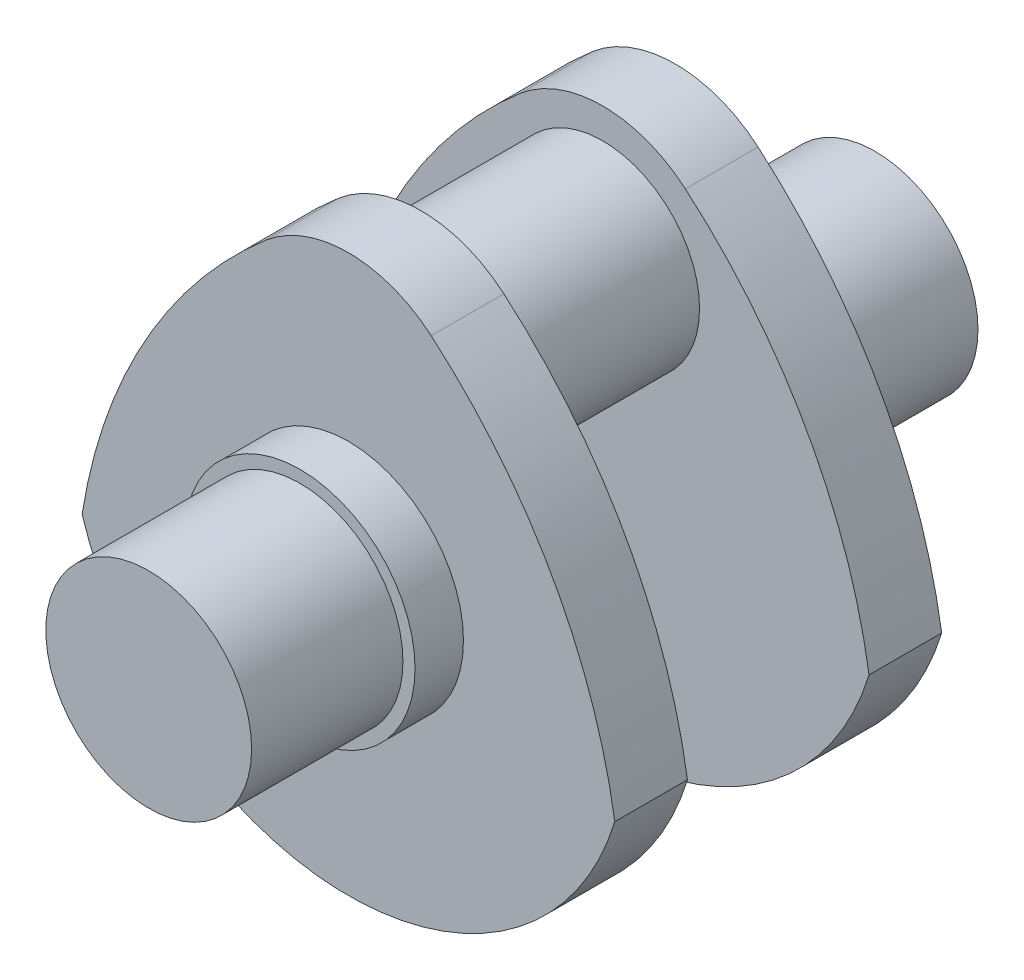
ISO-10303-21;
HEADER;
FILE_DESCRIPTION(('STEP AP214'),'2;1');
FILE_NAME('part.step','',(''),(''),'','','');
FILE_SCHEMA(('AUTOMOTIVE_DESIGN { 1 0 10303 214 1 1 1 1 }'));
ENDSEC;
DATA;
#1=APPLICATION_CONTEXT('core data for automotive mechanical design processes');
#2=APPLICATION_PROTOCOL_DEFINITION('international standard','automotive_design',2000,#1);
#3=PRODUCT_CONTEXT('',#1,'mechanical');
#4=PRODUCT('Part','Part','',(#3));
#5=PRODUCT_RELATED_PRODUCT_CATEGORY('part','',(#4));
#6=PRODUCT_DEFINITION_FORMATION('','',#4);
#7=PRODUCT_DEFINITION_CONTEXT('part definition',#1,'design');
#8=PRODUCT_DEFINITION('design','',#6,#7);
#9=PRODUCT_DEFINITION_SHAPE('','',#8);
#10=(LENGTH_UNIT() NAMED_UNIT(*) SI_UNIT(.MILLI.,.METRE.));
#11=(NAMED_UNIT(*) PLANE_ANGLE_UNIT() SI_UNIT($,.RADIAN.));
#12=(NAMED_UNIT(*) SI_UNIT($,.STERADIAN.) SOLID_ANGLE_UNIT());
#13=UNCERTAINTY_MEASURE_WITH_UNIT(LENGTH_MEASURE(1.E-05),#10,'distance_accuracy_value','');
#14=(GEOMETRIC_REPRESENTATION_CONTEXT(3) GLOBAL_UNCERTAINTY_ASSIGNED_CONTEXT((#13)) GLOBAL_UNIT_ASSIGNED_CONTEXT((#10,
#11,#12)) REPRESENTATION_CONTEXT('',''));
#15=CARTESIAN_POINT('',(0.,0.,0.));
#16=DIRECTION('',(0.,0.,1.));
#17=DIRECTION('',(1.,0.,0.));
#18=AXIS2_PLACEMENT_3D('',#15,#16,#17);
#19=CARTESIAN_POINT('',(0.,0.,25.));
#20=DIRECTION('',(0.,0.,-1.));
#21=DIRECTION('',(-1.,0.,0.));
#22=AXIS2_PLACEMENT_3D('',#19,#20,#21);
#23=CYLINDRICAL_SURFACE('',#22,17.);
#24=CARTESIAN_POINT('',(0.,0.,25.));
#25=DIRECTION('',(0.,0.,1.));
#26=DIRECTION('',(1.,0.,0.));
#27=AXIS2_PLACEMENT_3D('',#24,#25,#26);
#28=CIRCLE('',#27,17.);
#29=CARTESIAN_POINT('',(17.,0.,25.));
#30=VERTEX_POINT('',#29);
#31=EDGE_CURVE('E48',#30,#30,#28,.T.);
#32=ORIENTED_EDGE('',*,*,#31,.F.);
#33=EDGE_LOOP('',(#32));
#34=FACE_BOUND('',#33,.T.);
#35=CARTESIAN_POINT('',(0.,0.,0.));
#36=DIRECTION('',(0.,0.,1.));
#37=DIRECTION('',(1.,0.,0.));
#38=AXIS2_PLACEMENT_3D('',#35,#36,#37);
#39=CIRCLE('',#38,17.);
#40=CARTESIAN_POINT('',(17.,0.,0.));
#41=VERTEX_POINT('',#40);
#42=EDGE_CURVE('E231',#41,#41,#39,.T.);
#43=ORIENTED_EDGE('',*,*,#42,.T.);
#44=EDGE_LOOP('',(#43));
#45=FACE_BOUND('',#44,.T.);
#46=ADVANCED_FACE('F39',(#34,#45),#23,.T.);
#47=CARTESIAN_POINT('',(0.,0.,25.));
#48=DIRECTION('',(0.,0.,1.));
#49=DIRECTION('',(1.,0.,0.));
#50=AXIS2_PLACEMENT_3D('',#47,#48,#49);
#51=PLANE('',#50);
#52=ORIENTED_EDGE('',*,*,#31,.T.);
#53=EDGE_LOOP('',(#52));
#54=FACE_BOUND('',#53,.T.);
#55=ADVANCED_FACE('F248',(#54),#51,.T.);
#56=CARTESIAN_POINT('',(0.,0.,-8.));
#57=DIRECTION('',(0.,0.,1.));
#58=DIRECTION('',(1.,0.,0.));
#59=AXIS2_PLACEMENT_3D('',#56,#57,#58);
#60=CYLINDRICAL_SURFACE('',#59,19.);
#61=CARTESIAN_POINT('',(0.,0.,-8.));
#62=DIRECTION('',(0.,0.,1.));
#63=DIRECTION('',(1.,0.,0.));
#64=AXIS2_PLACEMENT_3D('',#61,#62,#63);
#65=CIRCLE('',#64,19.);
#66=CARTESIAN_POINT('',(19.,0.,-8.));
#67=VERTEX_POINT('',#66);
#68=EDGE_CURVE('E223',#67,#67,#65,.T.);
#69=ORIENTED_EDGE('',*,*,#68,.T.);
#70=EDGE_LOOP('',(#69));
#71=FACE_BOUND('',#70,.T.);
#72=CARTESIAN_POINT('',(0.,0.,0.));
#73=DIRECTION('',(0.,0.,1.));
#74=DIRECTION('',(1.,0.,0.));
#75=AXIS2_PLACEMENT_3D('',#72,#73,#74);
#76=CIRCLE('',#75,19.);
#77=CARTESIAN_POINT('',(19.,0.,0.));
#78=VERTEX_POINT('',#77);
#79=EDGE_CURVE('E227',#78,#78,#76,.T.);
#80=ORIENTED_EDGE('',*,*,#79,.F.);
#81=EDGE_LOOP('',(#80));
#82=FACE_BOUND('',#81,.T.);
#83=ADVANCED_FACE('F243',(#71,#82),#60,.T.);
#84=CARTESIAN_POINT('',(0.,0.,0.));
#85=DIRECTION('',(0.,0.,1.));
#86=DIRECTION('',(1.,0.,0.));
#87=AXIS2_PLACEMENT_3D('',#84,#85,#86);
#88=PLANE('',#87);
#89=ORIENTED_EDGE('',*,*,#42,.F.);
#90=EDGE_LOOP('',(#89));
#91=FACE_BOUND('',#90,.T.);
#92=ORIENTED_EDGE('',*,*,#79,.T.);
#93=EDGE_LOOP('',(#92));
#94=FACE_BOUND('',#93,.T.);
#95=ADVANCED_FACE('F239',(#91,#94),#88,.T.);
#96=CARTESIAN_POINT('',(44.9094542035734,-27.3845485151599,-20.));
#97=DIRECTION('',(0.,0.,1.));
#98=DIRECTION('',(1.,0.,0.));
#99=AXIS2_PLACEMENT_3D('',#96,#97,#98);
#100=CYLINDRICAL_SURFACE('',#99,90.);
#101=CARTESIAN_POINT('',(44.9094542035734,-27.3845485151599,-8.));
#102=DIRECTION('',(0.,0.,-1.));
#103=DIRECTION('',(1.,0.,0.));
#104=AXIS2_PLACEMENT_3D('',#101,#102,#103);
#105=CIRCLE('',#104,90.);
#106=CARTESIAN_POINT('',(-44.,-13.4164078649987,-8.));
#107=VERTEX_POINT('',#106);
#108=CARTESIAN_POINT('',(-13.6680947576093,40.9431234611356,-8.));
#109=VERTEX_POINT('',#108);
#110=EDGE_CURVE('E190',#107,#109,#105,.T.);
#111=ORIENTED_EDGE('',*,*,#110,.T.);
#112=DIRECTION('',(0.,0.,1.));
#113=VECTOR('',#112,1.);
#114=CARTESIAN_POINT('',(-13.6680947576093,40.9431234611356,-20.));
#115=LINE('',#114,#113);
#116=CARTESIAN_POINT('',(-13.6680947576093,40.9431234611356,-20.));
#117=VERTEX_POINT('',#116);
#118=EDGE_CURVE('E220',#117,#109,#115,.T.);
#119=ORIENTED_EDGE('',*,*,#118,.F.);
#120=CARTESIAN_POINT('',(44.9094542035734,-27.3845485151599,-20.));
#121=DIRECTION('',(0.,0.,-1.));
#122=DIRECTION('',(1.,0.,0.));
#123=AXIS2_PLACEMENT_3D('',#120,#121,#122);
#124=CIRCLE('',#123,90.);
#125=CARTESIAN_POINT('',(-44.,-13.4164078649987,-20.));
#126=VERTEX_POINT('',#125);
#127=EDGE_CURVE('E191',#126,#117,#124,.T.);
#128=ORIENTED_EDGE('',*,*,#127,.F.);
#129=DIRECTION('',(0.,0.,1.));
#130=VECTOR('',#129,1.);
#131=CARTESIAN_POINT('',(-44.,-13.4164078649987,-20.));
#132=LINE('',#131,#130);
#133=EDGE_CURVE('E201',#126,#107,#132,.T.);
#134=ORIENTED_EDGE('',*,*,#133,.T.);
#135=EDGE_LOOP('',(#111,#119,#128,#134));
#136=FACE_BOUND('',#135,.T.);
#137=ADVANCED_FACE('F242',(#136),#100,.T.);
#138=CARTESIAN_POINT('',(0.,25.,-20.));
#139=DIRECTION('',(0.,0.,1.));
#140=DIRECTION('',(1.,0.,0.));
#141=AXIS2_PLACEMENT_3D('',#138,#139,#140);
#142=CYLINDRICAL_SURFACE('',#141,21.);
#143=CARTESIAN_POINT('',(0.,25.,-8.));
#144=DIRECTION('',(0.,0.,-1.));
#145=DIRECTION('',(-1.,0.,0.));
#146=AXIS2_PLACEMENT_3D('',#143,#144,#145);
#147=CIRCLE('',#146,21.);
#148=CARTESIAN_POINT('',(13.6680947576093,40.9431234611356,-8.));
#149=VERTEX_POINT('',#148);
#150=EDGE_CURVE('E205',#109,#149,#147,.T.);
#151=ORIENTED_EDGE('',*,*,#150,.T.);
#152=DIRECTION('',(0.,0.,1.));
#153=VECTOR('',#152,1.);
#154=CARTESIAN_POINT('',(13.6680947576093,40.9431234611356,-20.));
#155=LINE('',#154,#153);
#156=CARTESIAN_POINT('',(13.6680947576093,40.9431234611356,-20.));
#157=VERTEX_POINT('',#156);
#158=EDGE_CURVE('E217',#157,#149,#155,.T.);
#159=ORIENTED_EDGE('',*,*,#158,.F.);
#160=CARTESIAN_POINT('',(0.,25.,-20.));
#161=DIRECTION('',(0.,0.,-1.));
#162=DIRECTION('',(-1.,0.,0.));
#163=AXIS2_PLACEMENT_3D('',#160,#161,#162);
#164=CIRCLE('',#163,21.);
#165=EDGE_CURVE('E88',#117,#157,#164,.T.);
#166=ORIENTED_EDGE('',*,*,#165,.F.);
#167=ORIENTED_EDGE('',*,*,#118,.T.);
#168=EDGE_LOOP('',(#151,#159,#166,#167));
#169=FACE_BOUND('',#168,.T.);
#170=ADVANCED_FACE('F283',(#169),#142,.T.);
#171=CARTESIAN_POINT('',(-44.9094542035734,-27.3845485151599,-20.));
#172=DIRECTION('',(0.,0.,1.));
#173=DIRECTION('',(1.,0.,0.));
#174=AXIS2_PLACEMENT_3D('',#171,#172,#173);
#175=CYLINDRICAL_SURFACE('',#174,90.);
#176=CARTESIAN_POINT('',(-44.9094542035734,-27.3845485151599,-8.));
#177=DIRECTION('',(0.,0.,-1.));
#178=DIRECTION('',(1.,0.,0.));
#179=AXIS2_PLACEMENT_3D('',#176,#177,#178);
#180=CIRCLE('',#179,90.);
#181=CARTESIAN_POINT('',(44.,-13.4164078649987,-8.));
#182=VERTEX_POINT('',#181);
#183=EDGE_CURVE('E74',#149,#182,#180,.T.);
#184=ORIENTED_EDGE('',*,*,#183,.T.);
#185=DIRECTION('',(0.,0.,1.));
#186=VECTOR('',#185,1.);
#187=CARTESIAN_POINT('',(44.,-13.4164078649987,-20.));
#188=LINE('',#187,#186);
#189=CARTESIAN_POINT('',(44.,-13.4164078649987,-20.));
#190=VERTEX_POINT('',#189);
#191=EDGE_CURVE('E214',#190,#182,#188,.T.);
#192=ORIENTED_EDGE('',*,*,#191,.F.);
#193=CARTESIAN_POINT('',(-44.9094542035734,-27.3845485151599,-20.));
#194=DIRECTION('',(0.,0.,-1.));
#195=DIRECTION('',(1.,0.,0.));
#196=AXIS2_PLACEMENT_3D('',#193,#194,#195);
#197=CIRCLE('',#196,90.);
#198=EDGE_CURVE('E196',#157,#190,#197,.T.);
#199=ORIENTED_EDGE('',*,*,#198,.F.);
#200=ORIENTED_EDGE('',*,*,#158,.T.);
#201=EDGE_LOOP('',(#184,#192,#199,#200));
#202=FACE_BOUND('',#201,.T.);
#203=ADVANCED_FACE('F292',(#202),#175,.T.);
#204=CARTESIAN_POINT('',(0.,0.,-20.));
#205=DIRECTION('',(0.,0.,1.));
#206=DIRECTION('',(1.,0.,0.));
#207=AXIS2_PLACEMENT_3D('',#204,#205,#206);
#208=CYLINDRICAL_SURFACE('',#207,46.);
#209=CARTESIAN_POINT('',(0.,0.,-8.));
#210=DIRECTION('',(0.,0.,-1.));
#211=DIRECTION('',(1.,0.,0.));
#212=AXIS2_PLACEMENT_3D('',#209,#210,#211);
#213=CIRCLE('',#212,46.);
#214=EDGE_CURVE('E80',#182,#107,#213,.T.);
#215=ORIENTED_EDGE('',*,*,#214,.T.);
#216=ORIENTED_EDGE('',*,*,#133,.F.);
#217=CARTESIAN_POINT('',(0.,0.,-20.));
#218=DIRECTION('',(0.,0.,-1.));
#219=DIRECTION('',(1.,0.,0.));
#220=AXIS2_PLACEMENT_3D('',#217,#218,#219);
#221=CIRCLE('',#220,46.);
#222=EDGE_CURVE('E56',#190,#126,#221,.T.);
#223=ORIENTED_EDGE('',*,*,#222,.F.);
#224=ORIENTED_EDGE('',*,*,#191,.T.);
#225=EDGE_LOOP('',(#215,#216,#223,#224));
#226=FACE_BOUND('',#225,.T.);
#227=ADVANCED_FACE('F300',(#226),#208,.T.);
#228=CARTESIAN_POINT('',(22.4547271017867,-13.69227425758,-20.));
#229=DIRECTION('',(0.,0.,1.));
#230=DIRECTION('',(1.,0.,0.));
#231=AXIS2_PLACEMENT_3D('',#228,#229,#230);
#232=PLANE('',#231);
#233=CARTESIAN_POINT('',(0.,25.,-20.));
#234=DIRECTION('',(0.,0.,1.));
#235=DIRECTION('',(1.,0.,0.));
#236=AXIS2_PLACEMENT_3D('',#233,#234,#235);
#237=CIRCLE('',#236,16.);
#238=CARTESIAN_POINT('',(16.,25.,-20.));
#239=VERTEX_POINT('',#238);
#240=EDGE_CURVE('E11',#239,#239,#237,.F.);
#241=ORIENTED_EDGE('',*,*,#240,.F.);
#242=EDGE_LOOP('',(#241));
#243=FACE_BOUND('',#242,.T.);
#244=ORIENTED_EDGE('',*,*,#127,.T.);
#245=ORIENTED_EDGE('',*,*,#165,.T.);
#246=ORIENTED_EDGE('',*,*,#198,.T.);
#247=ORIENTED_EDGE('',*,*,#222,.T.);
#248=EDGE_LOOP('',(#244,#245,#246,#247));
#249=FACE_BOUND('',#248,.T.);
#250=ADVANCED_FACE('F308',(#243,#249),#232,.F.);
#251=CARTESIAN_POINT('',(22.4547271017867,-13.69227425758,-8.));
#252=DIRECTION('',(0.,0.,1.));
#253=DIRECTION('',(1.,0.,0.));
#254=AXIS2_PLACEMENT_3D('',#251,#252,#253);
#255=PLANE('',#254);
#256=ORIENTED_EDGE('',*,*,#68,.F.);
#257=EDGE_LOOP('',(#256));
#258=FACE_BOUND('',#257,.T.);
#259=ORIENTED_EDGE('',*,*,#110,.F.);
#260=ORIENTED_EDGE('',*,*,#214,.F.);
#261=ORIENTED_EDGE('',*,*,#183,.F.);
#262=ORIENTED_EDGE('',*,*,#150,.F.);
#263=EDGE_LOOP('',(#259,#260,#261,#262));
#264=FACE_BOUND('',#263,.T.);
#265=ADVANCED_FACE('F317',(#258,#264),#255,.T.);
#266=CARTESIAN_POINT('',(0.,25.,-35.));
#267=DIRECTION('',(0.,0.,1.));
#268=DIRECTION('',(1.,0.,0.));
#269=AXIS2_PLACEMENT_3D('',#266,#267,#268);
#270=CYLINDRICAL_SURFACE('',#269,16.);
#271=ORIENTED_EDGE('',*,*,#240,.T.);
#272=EDGE_LOOP('',(#271));
#273=FACE_BOUND('',#272,.T.);
#274=CARTESIAN_POINT('',(0.,25.,-50.));
#275=DIRECTION('',(0.,0.,1.));
#276=DIRECTION('',(1.,0.,0.));
#277=AXIS2_PLACEMENT_3D('',#274,#275,#276);
#278=CIRCLE('',#277,16.);
#279=CARTESIAN_POINT('',(16.,25.,-50.));
#280=VERTEX_POINT('',#279);
#281=EDGE_CURVE('E183',#280,#280,#278,.F.);
#282=ORIENTED_EDGE('',*,*,#281,.F.);
#283=EDGE_LOOP('',(#282));
#284=FACE_BOUND('',#283,.T.);
#285=ADVANCED_FACE('F326',(#273,#284),#270,.T.);
#286=CARTESIAN_POINT('',(0.,0.,-95.));
#287=DIRECTION('',(0.,0.,1.));
#288=DIRECTION('',(-1.,0.,0.));
#289=AXIS2_PLACEMENT_3D('',#286,#287,#288);
#290=CYLINDRICAL_SURFACE('',#289,17.);
#291=CARTESIAN_POINT('',(0.,0.,-95.));
#292=DIRECTION('',(0.,0.,1.));
#293=DIRECTION('',(1.,0.,0.));
#294=AXIS2_PLACEMENT_3D('',#291,#292,#293);
#295=CIRCLE('',#294,17.);
#296=CARTESIAN_POINT('',(17.,0.,-95.));
#297=VERTEX_POINT('',#296);
#298=EDGE_CURVE('E179',#297,#297,#295,.T.);
#299=ORIENTED_EDGE('',*,*,#298,.T.);
#300=EDGE_LOOP('',(#299));
#301=FACE_BOUND('',#300,.T.);
#302=CARTESIAN_POINT('',(0.,0.,-70.));
#303=DIRECTION('',(0.,0.,1.));
#304=DIRECTION('',(1.,0.,0.));
#305=AXIS2_PLACEMENT_3D('',#302,#303,#304);
#306=CIRCLE('',#305,17.);
#307=CARTESIAN_POINT('',(17.,0.,-70.));
#308=VERTEX_POINT('',#307);
#309=EDGE_CURVE('E178',#308,#308,#306,.T.);
#310=ORIENTED_EDGE('',*,*,#309,.F.);
#311=EDGE_LOOP('',(#310));
#312=FACE_BOUND('',#311,.T.);
#313=ADVANCED_FACE('F335',(#301,#312),#290,.T.);
#314=CARTESIAN_POINT('',(0.,0.,-95.));
#315=DIRECTION('',(0.,0.,-1.));
#316=DIRECTION('',(1.,0.,0.));
#317=AXIS2_PLACEMENT_3D('',#314,#315,#316);
#318=PLANE('',#317);
#319=ORIENTED_EDGE('',*,*,#298,.F.);
#320=EDGE_LOOP('',(#319));
#321=FACE_BOUND('',#320,.T.);
#322=ADVANCED_FACE('F343',(#321),#318,.T.);
#323=CARTESIAN_POINT('',(0.,0.,-62.));
#324=DIRECTION('',(0.,0.,-1.));
#325=DIRECTION('',(1.,0.,0.));
#326=AXIS2_PLACEMENT_3D('',#323,#324,#325);
#327=CYLINDRICAL_SURFACE('',#326,19.);
#328=CARTESIAN_POINT('',(0.,0.,-62.));
#329=DIRECTION('',(0.,0.,1.));
#330=DIRECTION('',(1.,0.,0.));
#331=AXIS2_PLACEMENT_3D('',#328,#329,#330);
#332=CIRCLE('',#331,19.);
#333=CARTESIAN_POINT('',(19.,0.,-62.));
#334=VERTEX_POINT('',#333);
#335=EDGE_CURVE('E137',#334,#334,#332,.T.);
#336=ORIENTED_EDGE('',*,*,#335,.F.);
#337=EDGE_LOOP('',(#336));
#338=FACE_BOUND('',#337,.T.);
#339=CARTESIAN_POINT('',(0.,0.,-70.));
#340=DIRECTION('',(0.,0.,1.));
#341=DIRECTION('',(1.,0.,0.));
#342=AXIS2_PLACEMENT_3D('',#339,#340,#341);
#343=CIRCLE('',#342,19.);
#344=CARTESIAN_POINT('',(19.,0.,-70.));
#345=VERTEX_POINT('',#344);
#346=EDGE_CURVE('E174',#345,#345,#343,.T.);
#347=ORIENTED_EDGE('',*,*,#346,.T.);
#348=EDGE_LOOP('',(#347));
#349=FACE_BOUND('',#348,.T.);
#350=ADVANCED_FACE('F351',(#338,#349),#327,.T.);
#351=CARTESIAN_POINT('',(0.,0.,-70.));
#352=DIRECTION('',(0.,0.,-1.));
#353=DIRECTION('',(1.,0.,0.));
#354=AXIS2_PLACEMENT_3D('',#351,#352,#353);
#355=PLANE('',#354);
#356=ORIENTED_EDGE('',*,*,#309,.T.);
#357=EDGE_LOOP('',(#356));
#358=FACE_BOUND('',#357,.T.);
#359=ORIENTED_EDGE('',*,*,#346,.F.);
#360=EDGE_LOOP('',(#359));
#361=FACE_BOUND('',#360,.T.);
#362=ADVANCED_FACE('F359',(#358,#361),#355,.T.);
#363=CARTESIAN_POINT('',(44.9094542035734,-27.3845485151599,-50.));
#364=DIRECTION('',(0.,0.,-1.));
#365=DIRECTION('',(1.,0.,0.));
#366=AXIS2_PLACEMENT_3D('',#363,#364,#365);
#367=CYLINDRICAL_SURFACE('',#366,90.);
#368=CARTESIAN_POINT('',(44.9094542035734,-27.3845485151599,-62.));
#369=DIRECTION('',(0.,0.,-1.));
#370=DIRECTION('',(1.,0.,0.));
#371=AXIS2_PLACEMENT_3D('',#368,#369,#370);
#372=CIRCLE('',#371,90.);
#373=CARTESIAN_POINT('',(-44.,-13.4164078649987,-62.));
#374=VERTEX_POINT('',#373);
#375=CARTESIAN_POINT('',(-13.6680947576093,40.9431234611356,-62.));
#376=VERTEX_POINT('',#375);
#377=EDGE_CURVE('E155',#374,#376,#372,.T.);
#378=ORIENTED_EDGE('',*,*,#377,.F.);
#379=DIRECTION('',(0.,0.,-1.));
#380=VECTOR('',#379,1.);
#381=CARTESIAN_POINT('',(-44.,-13.4164078649987,-50.));
#382=LINE('',#381,#380);
#383=CARTESIAN_POINT('',(-44.,-13.4164078649987,-50.));
#384=VERTEX_POINT('',#383);
#385=EDGE_CURVE('E142',#384,#374,#382,.T.);
#386=ORIENTED_EDGE('',*,*,#385,.F.);
#387=CARTESIAN_POINT('',(44.9094542035734,-27.3845485151599,-50.));
#388=DIRECTION('',(0.,0.,-1.));
#389=DIRECTION('',(1.,0.,0.));
#390=AXIS2_PLACEMENT_3D('',#387,#388,#389);
#391=CIRCLE('',#390,90.);
#392=CARTESIAN_POINT('',(-13.6680947576093,40.9431234611356,-50.));
#393=VERTEX_POINT('',#392);
#394=EDGE_CURVE('E119',#384,#393,#391,.T.);
#395=ORIENTED_EDGE('',*,*,#394,.T.);
#396=DIRECTION('',(0.,0.,-1.));
#397=VECTOR('',#396,1.);
#398=CARTESIAN_POINT('',(-13.6680947576093,40.9431234611356,-50.));
#399=LINE('',#398,#397);
#400=EDGE_CURVE('E129',#393,#376,#399,.T.);
#401=ORIENTED_EDGE('',*,*,#400,.T.);
#402=EDGE_LOOP('',(#378,#386,#395,#401));
#403=FACE_BOUND('',#402,.T.);
#404=ADVANCED_FACE('F140',(#403),#367,.T.);
#405=CARTESIAN_POINT('',(0.,25.,-50.));
#406=DIRECTION('',(0.,0.,-1.));
#407=DIRECTION('',(1.,0.,0.));
#408=AXIS2_PLACEMENT_3D('',#405,#406,#407);
#409=CYLINDRICAL_SURFACE('',#408,21.);
#410=CARTESIAN_POINT('',(0.,25.,-62.));
#411=DIRECTION('',(0.,0.,-1.));
#412=DIRECTION('',(-1.,0.,0.));
#413=AXIS2_PLACEMENT_3D('',#410,#411,#412);
#414=CIRCLE('',#413,21.);
#415=CARTESIAN_POINT('',(13.6680947576093,40.9431234611356,-62.));
#416=VERTEX_POINT('',#415);
#417=EDGE_CURVE('E132',#376,#416,#414,.T.);
#418=ORIENTED_EDGE('',*,*,#417,.F.);
#419=ORIENTED_EDGE('',*,*,#400,.F.);
#420=CARTESIAN_POINT('',(0.,25.,-50.));
#421=DIRECTION('',(0.,0.,-1.));
#422=DIRECTION('',(-1.,0.,0.));
#423=AXIS2_PLACEMENT_3D('',#420,#421,#422);
#424=CIRCLE('',#423,21.);
#425=CARTESIAN_POINT('',(13.6680947576093,40.9431234611356,-50.));
#426=VERTEX_POINT('',#425);
#427=EDGE_CURVE('E115',#393,#426,#424,.T.);
#428=ORIENTED_EDGE('',*,*,#427,.T.);
#429=DIRECTION('',(0.,0.,-1.));
#430=VECTOR('',#429,1.);
#431=CARTESIAN_POINT('',(13.6680947576093,40.9431234611356,-50.));
#432=LINE('',#431,#430);
#433=EDGE_CURVE('E138',#426,#416,#432,.T.);
#434=ORIENTED_EDGE('',*,*,#433,.T.);
#435=EDGE_LOOP('',(#418,#419,#428,#434));
#436=FACE_BOUND('',#435,.T.);
#437=ADVANCED_FACE('F130',(#436),#409,.T.);
#438=CARTESIAN_POINT('',(-44.9094542035734,-27.3845485151599,-50.));
#439=DIRECTION('',(0.,0.,-1.));
#440=DIRECTION('',(1.,0.,0.));
#441=AXIS2_PLACEMENT_3D('',#438,#439,#440);
#442=CYLINDRICAL_SURFACE('',#441,90.);
#443=CARTESIAN_POINT('',(-44.9094542035734,-27.3845485151599,-62.));
#444=DIRECTION('',(0.,0.,-1.));
#445=DIRECTION('',(1.,0.,0.));
#446=AXIS2_PLACEMENT_3D('',#443,#444,#445);
#447=CIRCLE('',#446,90.);
#448=CARTESIAN_POINT('',(44.,-13.4164078649987,-62.));
#449=VERTEX_POINT('',#448);
#450=EDGE_CURVE('E147',#416,#449,#447,.T.);
#451=ORIENTED_EDGE('',*,*,#450,.F.);
#452=ORIENTED_EDGE('',*,*,#433,.F.);
#453=CARTESIAN_POINT('',(-44.9094542035734,-27.3845485151599,-50.));
#454=DIRECTION('',(0.,0.,-1.));
#455=DIRECTION('',(1.,0.,0.));
#456=AXIS2_PLACEMENT_3D('',#453,#454,#455);
#457=CIRCLE('',#456,90.);
#458=CARTESIAN_POINT('',(44.,-13.4164078649987,-50.));
#459=VERTEX_POINT('',#458);
#460=EDGE_CURVE('E122',#426,#459,#457,.T.);
#461=ORIENTED_EDGE('',*,*,#460,.T.);
#462=DIRECTION('',(0.,0.,-1.));
#463=VECTOR('',#462,1.);
#464=CARTESIAN_POINT('',(44.,-13.4164078649987,-50.));
#465=LINE('',#464,#463);
#466=EDGE_CURVE('E165',#459,#449,#465,.T.);
#467=ORIENTED_EDGE('',*,*,#466,.T.);
#468=EDGE_LOOP('',(#451,#452,#461,#467));
#469=FACE_BOUND('',#468,.T.);
#470=ADVANCED_FACE('F380',(#469),#442,.T.);
#471=CARTESIAN_POINT('',(0.,0.,-50.));
#472=DIRECTION('',(0.,0.,-1.));
#473=DIRECTION('',(1.,0.,0.));
#474=AXIS2_PLACEMENT_3D('',#471,#472,#473);
#475=CYLINDRICAL_SURFACE('',#474,46.);
#476=CARTESIAN_POINT('',(0.,0.,-62.));
#477=DIRECTION('',(0.,0.,-1.));
#478=DIRECTION('',(1.,0.,0.));
#479=AXIS2_PLACEMENT_3D('',#476,#477,#478);
#480=CIRCLE('',#479,46.);
#481=EDGE_CURVE('E144',#449,#374,#480,.T.);
#482=ORIENTED_EDGE('',*,*,#481,.F.);
#483=ORIENTED_EDGE('',*,*,#466,.F.);
#484=CARTESIAN_POINT('',(0.,0.,-50.));
#485=DIRECTION('',(0.,0.,-1.));
#486=DIRECTION('',(1.,0.,0.));
#487=AXIS2_PLACEMENT_3D('',#484,#485,#486);
#488=CIRCLE('',#487,46.);
#489=EDGE_CURVE('E152',#459,#384,#488,.T.);
#490=ORIENTED_EDGE('',*,*,#489,.T.);
#491=ORIENTED_EDGE('',*,*,#385,.T.);
#492=EDGE_LOOP('',(#482,#483,#490,#491));
#493=FACE_BOUND('',#492,.T.);
#494=ADVANCED_FACE('F387',(#493),#475,.T.);
#495=CARTESIAN_POINT('',(22.4547271017867,-13.69227425758,-50.));
#496=DIRECTION('',(0.,0.,-1.));
#497=DIRECTION('',(1.,0.,0.));
#498=AXIS2_PLACEMENT_3D('',#495,#496,#497);
#499=PLANE('',#498);
#500=ORIENTED_EDGE('',*,*,#281,.T.);
#501=EDGE_LOOP('',(#500));
#502=FACE_BOUND('',#501,.T.);
#503=ORIENTED_EDGE('',*,*,#394,.F.);
#504=ORIENTED_EDGE('',*,*,#489,.F.);
#505=ORIENTED_EDGE('',*,*,#460,.F.);
#506=ORIENTED_EDGE('',*,*,#427,.F.);
#507=EDGE_LOOP('',(#503,#504,#505,#506));
#508=FACE_BOUND('',#507,.T.);
#509=ADVANCED_FACE('F117',(#502,#508),#499,.F.);
#510=CARTESIAN_POINT('',(22.4547271017867,-13.69227425758,-62.));
#511=DIRECTION('',(0.,0.,-1.));
#512=DIRECTION('',(1.,0.,0.));
#513=AXIS2_PLACEMENT_3D('',#510,#511,#512);
#514=PLANE('',#513);
#515=ORIENTED_EDGE('',*,*,#335,.T.);
#516=EDGE_LOOP('',(#515));
#517=FACE_BOUND('',#516,.T.);
#518=ORIENTED_EDGE('',*,*,#377,.T.);
#519=ORIENTED_EDGE('',*,*,#417,.T.);
#520=ORIENTED_EDGE('',*,*,#450,.T.);
#521=ORIENTED_EDGE('',*,*,#481,.T.);
#522=EDGE_LOOP('',(#518,#519,#520,#521));
#523=FACE_BOUND('',#522,.T.);
#524=ADVANCED_FACE('F402',(#517,#523),#514,.T.);
#525=CLOSED_SHELL('',(#46,#55,#83,#95,#137,#170,#203,#227,#250,#265,#285,#313,#322,#350,#362,
#404,#437,#470,#494,#509,#524));
#526=MANIFOLD_SOLID_BREP('B2',#525);
#527=ADVANCED_BREP_SHAPE_REPRESENTATION('',(#18,#526),#14);
#528=SHAPE_DEFINITION_REPRESENTATION(#9,#527);
ENDSEC;
END-ISO-10303-21;
